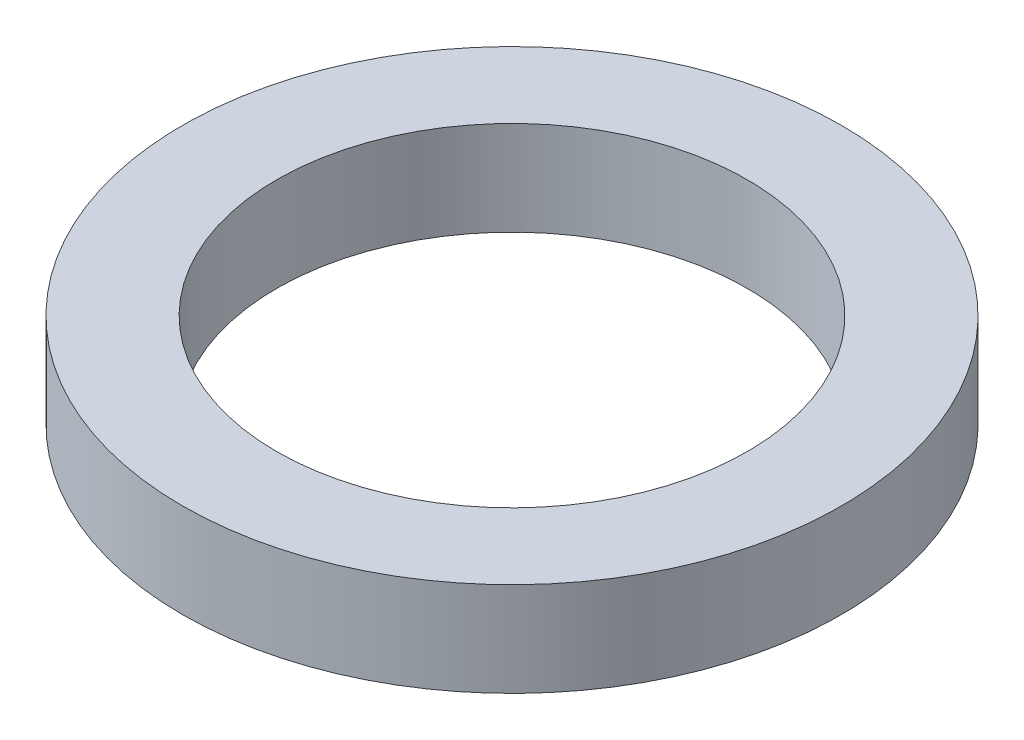
ISO-10303-21;
HEADER;
FILE_DESCRIPTION(('STEP AP214'),'2;1');
FILE_NAME('part.step','',(''),(''),'','','');
FILE_SCHEMA(('AUTOMOTIVE_DESIGN { 1 0 10303 214 1 1 1 1 }'));
ENDSEC;
DATA;
#1=APPLICATION_CONTEXT('core data for automotive mechanical design processes');
#2=APPLICATION_PROTOCOL_DEFINITION('international standard','automotive_design',2000,#1);
#3=PRODUCT_CONTEXT('',#1,'mechanical');
#4=PRODUCT('Part','Part','',(#3));
#5=PRODUCT_RELATED_PRODUCT_CATEGORY('part','',(#4));
#6=PRODUCT_DEFINITION_FORMATION('','',#4);
#7=PRODUCT_DEFINITION_CONTEXT('part definition',#1,'design');
#8=PRODUCT_DEFINITION('design','',#6,#7);
#9=PRODUCT_DEFINITION_SHAPE('','',#8);
#10=(LENGTH_UNIT() NAMED_UNIT(*) SI_UNIT(.MILLI.,.METRE.));
#11=(NAMED_UNIT(*) PLANE_ANGLE_UNIT() SI_UNIT($,.RADIAN.));
#12=(NAMED_UNIT(*) SI_UNIT($,.STERADIAN.) SOLID_ANGLE_UNIT());
#13=UNCERTAINTY_MEASURE_WITH_UNIT(LENGTH_MEASURE(1.E-05),#10,'distance_accuracy_value','');
#14=(GEOMETRIC_REPRESENTATION_CONTEXT(3) GLOBAL_UNCERTAINTY_ASSIGNED_CONTEXT((#13)) GLOBAL_UNIT_ASSIGNED_CONTEXT((#10,
#11,#12)) REPRESENTATION_CONTEXT('',''));
#15=CARTESIAN_POINT('',(0.,0.,0.));
#16=DIRECTION('',(0.,0.,1.));
#17=DIRECTION('',(1.,0.,0.));
#18=AXIS2_PLACEMENT_3D('',#15,#16,#17);
#19=CARTESIAN_POINT('',(0.,0.5,0.));
#20=DIRECTION('',(0.,1.,0.));
#21=DIRECTION('',(0.,0.,1.));
#22=AXIS2_PLACEMENT_3D('',#19,#20,#21);
#23=PLANE('',#22);
#24=CARTESIAN_POINT('',(0.,0.5,0.));
#25=DIRECTION('',(0.,1.,0.));
#26=DIRECTION('',(0.,0.,1.));
#27=AXIS2_PLACEMENT_3D('',#24,#25,#26);
#28=CIRCLE('',#27,1.75);
#29=CARTESIAN_POINT('',(0.,0.5,1.75));
#30=VERTEX_POINT('',#29);
#31=EDGE_CURVE('E10',#30,#30,#28,.T.);
#32=ORIENTED_EDGE('',*,*,#31,.T.);
#33=EDGE_LOOP('',(#32));
#34=FACE_BOUND('',#33,.T.);
#35=CARTESIAN_POINT('',(0.,0.5,0.));
#36=DIRECTION('',(0.,1.,0.));
#37=DIRECTION('',(0.,0.,1.));
#38=AXIS2_PLACEMENT_3D('',#35,#36,#37);
#39=CIRCLE('',#38,1.25);
#40=CARTESIAN_POINT('',(0.,0.5,1.25));
#41=VERTEX_POINT('',#40);
#42=EDGE_CURVE('E48',#41,#41,#39,.T.);
#43=ORIENTED_EDGE('',*,*,#42,.F.);
#44=EDGE_LOOP('',(#43));
#45=FACE_BOUND('',#44,.T.);
#46=ADVANCED_FACE('F37',(#34,#45),#23,.T.);
#47=CARTESIAN_POINT('',(0.,0.,0.));
#48=DIRECTION('',(0.,1.,0.));
#49=DIRECTION('',(0.,0.,1.));
#50=AXIS2_PLACEMENT_3D('',#47,#48,#49);
#51=PLANE('',#50);
#52=CARTESIAN_POINT('',(0.,0.,0.));
#53=DIRECTION('',(0.,1.,0.));
#54=DIRECTION('',(0.,0.,1.));
#55=AXIS2_PLACEMENT_3D('',#52,#53,#54);
#56=CIRCLE('',#55,1.75);
#57=CARTESIAN_POINT('',(0.,0.,1.75));
#58=VERTEX_POINT('',#57);
#59=EDGE_CURVE('E41',#58,#58,#56,.T.);
#60=ORIENTED_EDGE('',*,*,#59,.F.);
#61=EDGE_LOOP('',(#60));
#62=FACE_BOUND('',#61,.T.);
#63=CARTESIAN_POINT('',(0.,0.,0.));
#64=DIRECTION('',(0.,1.,0.));
#65=DIRECTION('',(0.,0.,1.));
#66=AXIS2_PLACEMENT_3D('',#63,#64,#65);
#67=CIRCLE('',#66,1.25);
#68=CARTESIAN_POINT('',(0.,0.,1.25));
#69=VERTEX_POINT('',#68);
#70=EDGE_CURVE('E50',#69,#69,#67,.T.);
#71=ORIENTED_EDGE('',*,*,#70,.T.);
#72=EDGE_LOOP('',(#71));
#73=FACE_BOUND('',#72,.T.);
#74=ADVANCED_FACE('F60',(#62,#73),#51,.F.);
#75=CARTESIAN_POINT('',(0.,0.5,0.));
#76=DIRECTION('',(0.,-1.,0.));
#77=DIRECTION('',(0.,0.,-1.));
#78=AXIS2_PLACEMENT_3D('',#75,#76,#77);
#79=CYLINDRICAL_SURFACE('',#78,1.75);
#80=ORIENTED_EDGE('',*,*,#31,.F.);
#81=EDGE_LOOP('',(#80));
#82=FACE_BOUND('',#81,.T.);
#83=ORIENTED_EDGE('',*,*,#59,.T.);
#84=EDGE_LOOP('',(#83));
#85=FACE_BOUND('',#84,.T.);
#86=ADVANCED_FACE('F39',(#82,#85),#79,.T.);
#87=CARTESIAN_POINT('',(0.,0.5,0.));
#88=DIRECTION('',(0.,-1.,0.));
#89=DIRECTION('',(0.,0.,-1.));
#90=AXIS2_PLACEMENT_3D('',#87,#88,#89);
#91=CYLINDRICAL_SURFACE('',#90,1.25);
#92=ORIENTED_EDGE('',*,*,#42,.T.);
#93=EDGE_LOOP('',(#92));
#94=FACE_BOUND('',#93,.T.);
#95=ORIENTED_EDGE('',*,*,#70,.F.);
#96=EDGE_LOOP('',(#95));
#97=FACE_BOUND('',#96,.T.);
#98=ADVANCED_FACE('F56',(#94,#97),#91,.F.);
#99=CLOSED_SHELL('',(#46,#74,#86,#98));
#100=MANIFOLD_SOLID_BREP('B2',#99);
#101=ADVANCED_BREP_SHAPE_REPRESENTATION('',(#18,#100),#14);
#102=SHAPE_DEFINITION_REPRESENTATION(#9,#101);
ENDSEC;
END-ISO-10303-21;
